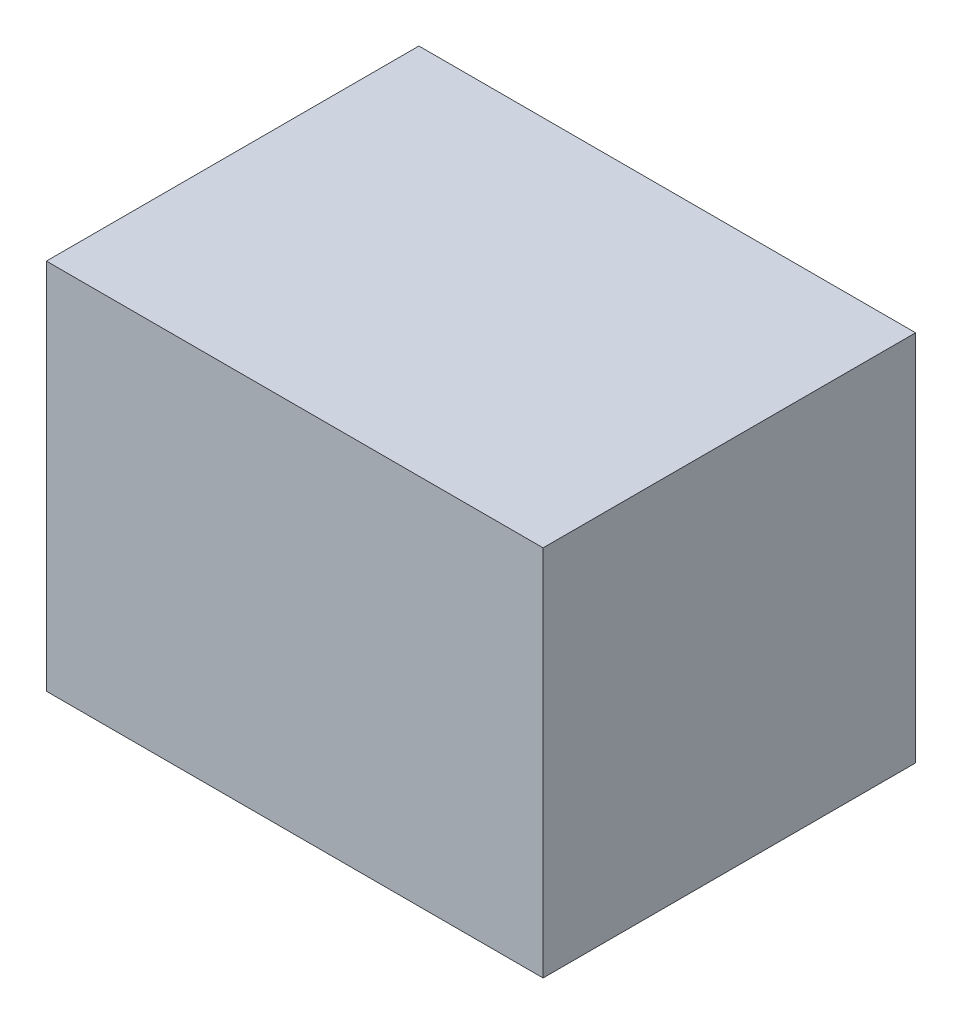
ISO-10303-21;
HEADER;
FILE_DESCRIPTION(('STEP AP214'),'2;1');
FILE_NAME('part.step','',(''),(''),'','','');
FILE_SCHEMA(('AUTOMOTIVE_DESIGN { 1 0 10303 214 1 1 1 1 }'));
ENDSEC;
DATA;
#1=APPLICATION_CONTEXT('core data for automotive mechanical design processes');
#2=APPLICATION_PROTOCOL_DEFINITION('international standard','automotive_design',2000,#1);
#3=PRODUCT_CONTEXT('',#1,'mechanical');
#4=PRODUCT('Part','Part','',(#3));
#5=PRODUCT_RELATED_PRODUCT_CATEGORY('part','',(#4));
#6=PRODUCT_DEFINITION_FORMATION('','',#4);
#7=PRODUCT_DEFINITION_CONTEXT('part definition',#1,'design');
#8=PRODUCT_DEFINITION('design','',#6,#7);
#9=PRODUCT_DEFINITION_SHAPE('','',#8);
#10=(LENGTH_UNIT() NAMED_UNIT(*) SI_UNIT(.MILLI.,.METRE.));
#11=(NAMED_UNIT(*) PLANE_ANGLE_UNIT() SI_UNIT($,.RADIAN.));
#12=(NAMED_UNIT(*) SI_UNIT($,.STERADIAN.) SOLID_ANGLE_UNIT());
#13=UNCERTAINTY_MEASURE_WITH_UNIT(LENGTH_MEASURE(1.E-05),#10,'distance_accuracy_value','');
#14=(GEOMETRIC_REPRESENTATION_CONTEXT(3) GLOBAL_UNCERTAINTY_ASSIGNED_CONTEXT((#13)) GLOBAL_UNIT_ASSIGNED_CONTEXT((#10,
#11,#12)) REPRESENTATION_CONTEXT('',''));
#15=CARTESIAN_POINT('',(0.,0.,0.));
#16=DIRECTION('',(0.,0.,1.));
#17=DIRECTION('',(1.,0.,0.));
#18=AXIS2_PLACEMENT_3D('',#15,#16,#17);
#19=CARTESIAN_POINT('',(20.,30.,-15.));
#20=DIRECTION('',(-1.,0.,0.));
#21=DIRECTION('',(0.,0.,1.));
#22=AXIS2_PLACEMENT_3D('',#19,#20,#21);
#23=PLANE('',#22);
#24=DIRECTION('',(0.,0.,-1.));
#25=VECTOR('',#24,1.);
#26=CARTESIAN_POINT('',(20.,0.,-15.));
#27=LINE('',#26,#25);
#28=CARTESIAN_POINT('',(20.,0.,15.));
#29=VERTEX_POINT('',#28);
#30=CARTESIAN_POINT('',(20.,0.,-15.));
#31=VERTEX_POINT('',#30);
#32=EDGE_CURVE('E97',#29,#31,#27,.T.);
#33=ORIENTED_EDGE('',*,*,#32,.T.);
#34=DIRECTION('',(0.,-1.,0.));
#35=VECTOR('',#34,1.);
#36=CARTESIAN_POINT('',(20.,30.,-15.));
#37=LINE('',#36,#35);
#38=CARTESIAN_POINT('',(20.,30.,-15.));
#39=VERTEX_POINT('',#38);
#40=EDGE_CURVE('E11',#39,#31,#37,.T.);
#41=ORIENTED_EDGE('',*,*,#40,.F.);
#42=DIRECTION('',(0.,0.,-1.));
#43=VECTOR('',#42,1.);
#44=CARTESIAN_POINT('',(20.,30.,-15.));
#45=LINE('',#44,#43);
#46=CARTESIAN_POINT('',(20.,30.,15.));
#47=VERTEX_POINT('',#46);
#48=EDGE_CURVE('E85',#47,#39,#45,.T.);
#49=ORIENTED_EDGE('',*,*,#48,.F.);
#50=DIRECTION('',(0.,-1.,0.));
#51=VECTOR('',#50,1.);
#52=CARTESIAN_POINT('',(20.,30.,15.));
#53=LINE('',#52,#51);
#54=EDGE_CURVE('E93',#47,#29,#53,.T.);
#55=ORIENTED_EDGE('',*,*,#54,.T.);
#56=EDGE_LOOP('',(#33,#41,#49,#55));
#57=FACE_BOUND('',#56,.T.);
#58=ADVANCED_FACE('F34',(#57),#23,.F.);
#59=CARTESIAN_POINT('',(-20.,30.,-15.));
#60=DIRECTION('',(0.,0.,1.));
#61=DIRECTION('',(1.,0.,0.));
#62=AXIS2_PLACEMENT_3D('',#59,#60,#61);
#63=PLANE('',#62);
#64=DIRECTION('',(-1.,0.,0.));
#65=VECTOR('',#64,1.);
#66=CARTESIAN_POINT('',(-20.,0.,-15.));
#67=LINE('',#66,#65);
#68=CARTESIAN_POINT('',(-20.,0.,-15.));
#69=VERTEX_POINT('',#68);
#70=EDGE_CURVE('E89',#31,#69,#67,.T.);
#71=ORIENTED_EDGE('',*,*,#70,.T.);
#72=DIRECTION('',(0.,-1.,0.));
#73=VECTOR('',#72,1.);
#74=CARTESIAN_POINT('',(-20.,30.,-15.));
#75=LINE('',#74,#73);
#76=CARTESIAN_POINT('',(-20.,30.,-15.));
#77=VERTEX_POINT('',#76);
#78=EDGE_CURVE('E42',#77,#69,#75,.T.);
#79=ORIENTED_EDGE('',*,*,#78,.F.);
#80=DIRECTION('',(-1.,0.,0.));
#81=VECTOR('',#80,1.);
#82=CARTESIAN_POINT('',(-20.,30.,-15.));
#83=LINE('',#82,#81);
#84=EDGE_CURVE('E80',#39,#77,#83,.T.);
#85=ORIENTED_EDGE('',*,*,#84,.F.);
#86=ORIENTED_EDGE('',*,*,#40,.T.);
#87=EDGE_LOOP('',(#71,#79,#85,#86));
#88=FACE_BOUND('',#87,.T.);
#89=ADVANCED_FACE('F88',(#88),#63,.F.);
#90=CARTESIAN_POINT('',(-20.,30.,-15.));
#91=DIRECTION('',(1.,0.,0.));
#92=DIRECTION('',(0.,0.,-1.));
#93=AXIS2_PLACEMENT_3D('',#90,#91,#92);
#94=PLANE('',#93);
#95=DIRECTION('',(0.,0.,1.));
#96=VECTOR('',#95,1.);
#97=CARTESIAN_POINT('',(-20.,0.,-15.));
#98=LINE('',#97,#96);
#99=CARTESIAN_POINT('',(-20.,0.,15.));
#100=VERTEX_POINT('',#99);
#101=EDGE_CURVE('E67',#69,#100,#98,.T.);
#102=ORIENTED_EDGE('',*,*,#101,.T.);
#103=DIRECTION('',(0.,-1.,0.));
#104=VECTOR('',#103,1.);
#105=CARTESIAN_POINT('',(-20.,30.,15.));
#106=LINE('',#105,#104);
#107=CARTESIAN_POINT('',(-20.,30.,15.));
#108=VERTEX_POINT('',#107);
#109=EDGE_CURVE('E90',#108,#100,#106,.T.);
#110=ORIENTED_EDGE('',*,*,#109,.F.);
#111=DIRECTION('',(0.,0.,1.));
#112=VECTOR('',#111,1.);
#113=CARTESIAN_POINT('',(-20.,30.,-15.));
#114=LINE('',#113,#112);
#115=EDGE_CURVE('E83',#77,#108,#114,.T.);
#116=ORIENTED_EDGE('',*,*,#115,.F.);
#117=ORIENTED_EDGE('',*,*,#78,.T.);
#118=EDGE_LOOP('',(#102,#110,#116,#117));
#119=FACE_BOUND('',#118,.T.);
#120=ADVANCED_FACE('F91',(#119),#94,.F.);
#121=CARTESIAN_POINT('',(-20.,30.,15.));
#122=DIRECTION('',(0.,0.,-1.));
#123=DIRECTION('',(-1.,0.,0.));
#124=AXIS2_PLACEMENT_3D('',#121,#122,#123);
#125=PLANE('',#124);
#126=DIRECTION('',(1.,0.,0.));
#127=VECTOR('',#126,1.);
#128=CARTESIAN_POINT('',(-20.,0.,15.));
#129=LINE('',#128,#127);
#130=EDGE_CURVE('E73',#100,#29,#129,.T.);
#131=ORIENTED_EDGE('',*,*,#130,.T.);
#132=ORIENTED_EDGE('',*,*,#54,.F.);
#133=DIRECTION('',(1.,0.,0.));
#134=VECTOR('',#133,1.);
#135=CARTESIAN_POINT('',(-20.,30.,15.));
#136=LINE('',#135,#134);
#137=EDGE_CURVE('E50',#108,#47,#136,.T.);
#138=ORIENTED_EDGE('',*,*,#137,.F.);
#139=ORIENTED_EDGE('',*,*,#109,.T.);
#140=EDGE_LOOP('',(#131,#132,#138,#139));
#141=FACE_BOUND('',#140,.T.);
#142=ADVANCED_FACE('F104',(#141),#125,.F.);
#143=CARTESIAN_POINT('',(0.,30.,0.));
#144=DIRECTION('',(0.,1.,0.));
#145=DIRECTION('',(0.,0.,1.));
#146=AXIS2_PLACEMENT_3D('',#143,#144,#145);
#147=PLANE('',#146);
#148=ORIENTED_EDGE('',*,*,#48,.T.);
#149=ORIENTED_EDGE('',*,*,#84,.T.);
#150=ORIENTED_EDGE('',*,*,#115,.T.);
#151=ORIENTED_EDGE('',*,*,#137,.T.);
#152=EDGE_LOOP('',(#148,#149,#150,#151));
#153=FACE_BOUND('',#152,.T.);
#154=ADVANCED_FACE('F81',(#153),#147,.T.);
#155=CARTESIAN_POINT('',(0.,0.,0.));
#156=DIRECTION('',(0.,1.,0.));
#157=DIRECTION('',(0.,0.,1.));
#158=AXIS2_PLACEMENT_3D('',#155,#156,#157);
#159=PLANE('',#158);
#160=ORIENTED_EDGE('',*,*,#32,.F.);
#161=ORIENTED_EDGE('',*,*,#130,.F.);
#162=ORIENTED_EDGE('',*,*,#101,.F.);
#163=ORIENTED_EDGE('',*,*,#70,.F.);
#164=EDGE_LOOP('',(#160,#161,#162,#163));
#165=FACE_BOUND('',#164,.T.);
#166=ADVANCED_FACE('F107',(#165),#159,.F.);
#167=CLOSED_SHELL('',(#58,#89,#120,#142,#154,#166));
#168=MANIFOLD_SOLID_BREP('B2',#167);
#169=ADVANCED_BREP_SHAPE_REPRESENTATION('',(#18,#168),#14);
#170=SHAPE_DEFINITION_REPRESENTATION(#9,#169);
ENDSEC;
END-ISO-10303-21;
